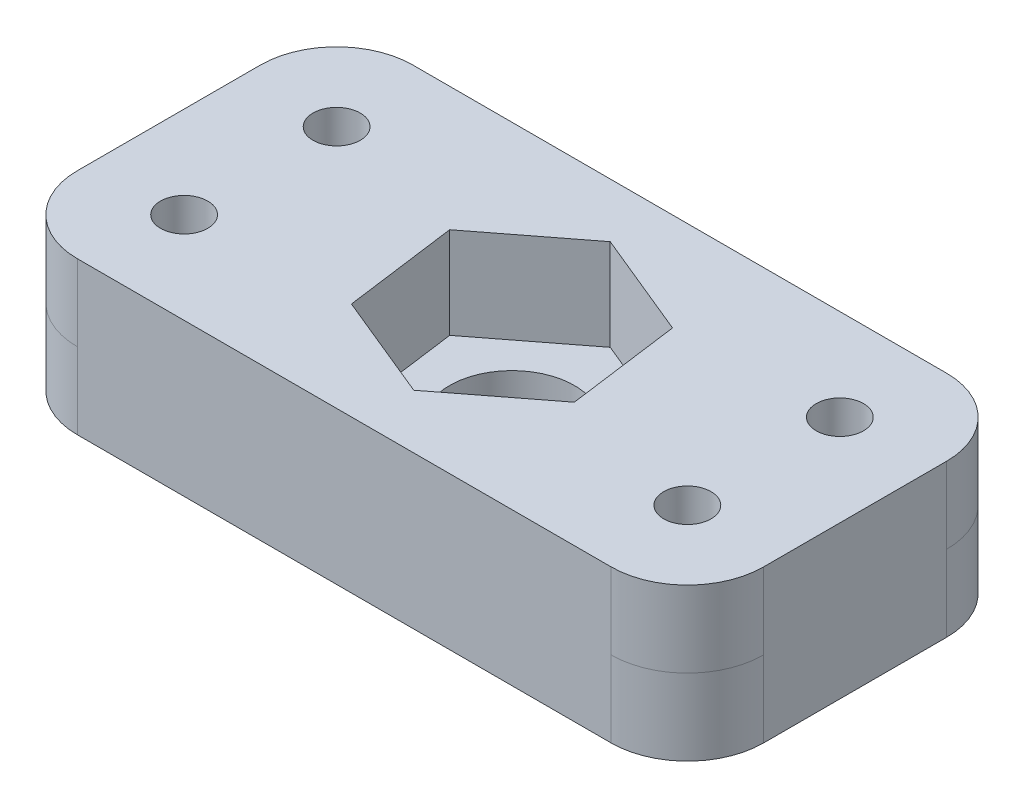
ISO-10303-21;
HEADER;
FILE_DESCRIPTION(('STEP AP214'),'2;1');
FILE_NAME('part.step','',(''),(''),'','','');
FILE_SCHEMA(('AUTOMOTIVE_DESIGN { 1 0 10303 214 1 1 1 1 }'));
ENDSEC;
DATA;
#1=APPLICATION_CONTEXT('core data for automotive mechanical design processes');
#2=APPLICATION_PROTOCOL_DEFINITION('international standard','automotive_design',2000,#1);
#3=PRODUCT_CONTEXT('',#1,'mechanical');
#4=PRODUCT('Part','Part','',(#3));
#5=PRODUCT_RELATED_PRODUCT_CATEGORY('part','',(#4));
#6=PRODUCT_DEFINITION_FORMATION('','',#4);
#7=PRODUCT_DEFINITION_CONTEXT('part definition',#1,'design');
#8=PRODUCT_DEFINITION('design','',#6,#7);
#9=PRODUCT_DEFINITION_SHAPE('','',#8);
#10=(LENGTH_UNIT() NAMED_UNIT(*) SI_UNIT(.MILLI.,.METRE.));
#11=(NAMED_UNIT(*) PLANE_ANGLE_UNIT() SI_UNIT($,.RADIAN.));
#12=(NAMED_UNIT(*) SI_UNIT($,.STERADIAN.) SOLID_ANGLE_UNIT());
#13=UNCERTAINTY_MEASURE_WITH_UNIT(LENGTH_MEASURE(1.E-05),#10,'distance_accuracy_value','');
#14=(GEOMETRIC_REPRESENTATION_CONTEXT(3) GLOBAL_UNCERTAINTY_ASSIGNED_CONTEXT((#13)) GLOBAL_UNIT_ASSIGNED_CONTEXT((#10,
#11,#12)) REPRESENTATION_CONTEXT('',''));
#15=CARTESIAN_POINT('',(0.,0.,0.));
#16=DIRECTION('',(0.,0.,1.));
#17=DIRECTION('',(1.,0.,0.));
#18=AXIS2_PLACEMENT_3D('',#15,#16,#17);
#19=CARTESIAN_POINT('',(0.,45.,0.));
#20=DIRECTION('',(0.,-1.,0.));
#21=DIRECTION('',(0.,0.,-1.));
#22=AXIS2_PLACEMENT_3D('',#19,#20,#21);
#23=CYLINDRICAL_SURFACE('',#22,4.1);
#24=CARTESIAN_POINT('',(0.,7.,0.));
#25=DIRECTION('',(0.,1.,0.));
#26=DIRECTION('',(0.,0.,1.));
#27=AXIS2_PLACEMENT_3D('',#24,#25,#26);
#28=CIRCLE('',#27,4.1);
#29=CARTESIAN_POINT('',(0.,7.,4.1));
#30=VERTEX_POINT('',#29);
#31=EDGE_CURVE('E348',#30,#30,#28,.T.);
#32=ORIENTED_EDGE('',*,*,#31,.F.);
#33=EDGE_LOOP('',(#32));
#34=FACE_BOUND('',#33,.T.);
#35=CARTESIAN_POINT('',(0.,11.,0.));
#36=DIRECTION('',(0.,1.,0.));
#37=DIRECTION('',(0.,0.,1.));
#38=AXIS2_PLACEMENT_3D('',#35,#36,#37);
#39=CIRCLE('',#38,4.1);
#40=CARTESIAN_POINT('',(0.,11.,4.1));
#41=VERTEX_POINT('',#40);
#42=EDGE_CURVE('E37',#41,#41,#39,.F.);
#43=ORIENTED_EDGE('',*,*,#42,.F.);
#44=EDGE_LOOP('',(#43));
#45=FACE_BOUND('',#44,.T.);
#46=ADVANCED_FACE('F33',(#34,#45),#23,.F.);
#47=CARTESIAN_POINT('',(-22.5,17.,-11.));
#48=DIRECTION('',(1.,0.,0.));
#49=DIRECTION('',(0.,0.,-1.));
#50=AXIS2_PLACEMENT_3D('',#47,#48,#49);
#51=PLANE('',#50);
#52=DIRECTION('',(0.,0.,-1.));
#53=VECTOR('',#52,1.);
#54=CARTESIAN_POINT('',(-22.5,7.,11.));
#55=LINE('',#54,#53);
#56=CARTESIAN_POINT('',(-22.5,7.,6.));
#57=VERTEX_POINT('',#56);
#58=CARTESIAN_POINT('',(-22.5,7.,-6.));
#59=VERTEX_POINT('',#58);
#60=EDGE_CURVE('E215',#57,#59,#55,.T.);
#61=ORIENTED_EDGE('',*,*,#60,.F.);
#62=DIRECTION('',(0.,1.,0.));
#63=VECTOR('',#62,1.);
#64=CARTESIAN_POINT('',(-22.5,17.,6.));
#65=LINE('',#64,#63);
#66=CARTESIAN_POINT('',(-22.5,12.,6.));
#67=VERTEX_POINT('',#66);
#68=EDGE_CURVE('E330',#57,#67,#65,.T.);
#69=ORIENTED_EDGE('',*,*,#68,.T.);
#70=DIRECTION('',(0.,-1.,0.));
#71=VECTOR('',#70,1.);
#72=CARTESIAN_POINT('',(-22.5,17.,6.));
#73=LINE('',#72,#71);
#74=CARTESIAN_POINT('',(-22.5,17.,6.));
#75=VERTEX_POINT('',#74);
#76=EDGE_CURVE('E435',#67,#75,#73,.F.);
#77=ORIENTED_EDGE('',*,*,#76,.T.);
#78=DIRECTION('',(0.,0.,1.));
#79=VECTOR('',#78,1.);
#80=CARTESIAN_POINT('',(-22.5,17.,-11.));
#81=LINE('',#80,#79);
#82=CARTESIAN_POINT('',(-22.5,17.,-6.));
#83=VERTEX_POINT('',#82);
#84=EDGE_CURVE('E227',#83,#75,#81,.T.);
#85=ORIENTED_EDGE('',*,*,#84,.F.);
#86=DIRECTION('',(0.,-1.,0.));
#87=VECTOR('',#86,1.);
#88=CARTESIAN_POINT('',(-22.5,17.,-6.));
#89=LINE('',#88,#87);
#90=CARTESIAN_POINT('',(-22.5,12.,-6.));
#91=VERTEX_POINT('',#90);
#92=EDGE_CURVE('E257',#83,#91,#89,.T.);
#93=ORIENTED_EDGE('',*,*,#92,.T.);
#94=DIRECTION('',(0.,1.,0.));
#95=VECTOR('',#94,1.);
#96=CARTESIAN_POINT('',(-22.5,17.,-6.));
#97=LINE('',#96,#95);
#98=EDGE_CURVE('E300',#91,#59,#97,.F.);
#99=ORIENTED_EDGE('',*,*,#98,.T.);
#100=EDGE_LOOP('',(#61,#69,#77,#85,#93,#99));
#101=FACE_BOUND('',#100,.T.);
#102=ADVANCED_FACE('F356',(#101),#51,.F.);
#103=CARTESIAN_POINT('',(22.5,17.,11.));
#104=DIRECTION('',(0.,0.,-1.));
#105=DIRECTION('',(-1.,0.,0.));
#106=AXIS2_PLACEMENT_3D('',#103,#104,#105);
#107=PLANE('',#106);
#108=DIRECTION('',(0.,-1.,0.));
#109=VECTOR('',#108,1.);
#110=CARTESIAN_POINT('',(-17.5,17.,11.));
#111=LINE('',#110,#109);
#112=CARTESIAN_POINT('',(-17.5,17.,11.));
#113=VERTEX_POINT('',#112);
#114=CARTESIAN_POINT('',(-17.5,12.,11.));
#115=VERTEX_POINT('',#114);
#116=EDGE_CURVE('E424',#113,#115,#111,.T.);
#117=ORIENTED_EDGE('',*,*,#116,.T.);
#118=DIRECTION('',(0.,1.,0.));
#119=VECTOR('',#118,1.);
#120=CARTESIAN_POINT('',(-17.5,17.,11.));
#121=LINE('',#120,#119);
#122=CARTESIAN_POINT('',(-17.5,7.,11.));
#123=VERTEX_POINT('',#122);
#124=EDGE_CURVE('E42',#115,#123,#121,.F.);
#125=ORIENTED_EDGE('',*,*,#124,.T.);
#126=DIRECTION('',(-1.,0.,0.));
#127=VECTOR('',#126,1.);
#128=CARTESIAN_POINT('',(22.5,7.,11.));
#129=LINE('',#128,#127);
#130=CARTESIAN_POINT('',(17.5,7.,11.));
#131=VERTEX_POINT('',#130);
#132=EDGE_CURVE('E224',#131,#123,#129,.T.);
#133=ORIENTED_EDGE('',*,*,#132,.F.);
#134=DIRECTION('',(0.,1.,0.));
#135=VECTOR('',#134,1.);
#136=CARTESIAN_POINT('',(17.5,17.,11.));
#137=LINE('',#136,#135);
#138=CARTESIAN_POINT('',(17.5,12.,11.));
#139=VERTEX_POINT('',#138);
#140=EDGE_CURVE('E319',#131,#139,#137,.T.);
#141=ORIENTED_EDGE('',*,*,#140,.T.);
#142=DIRECTION('',(0.,-1.,0.));
#143=VECTOR('',#142,1.);
#144=CARTESIAN_POINT('',(17.5,17.,11.));
#145=LINE('',#144,#143);
#146=CARTESIAN_POINT('',(17.5,17.,11.));
#147=VERTEX_POINT('',#146);
#148=EDGE_CURVE('E290',#139,#147,#145,.F.);
#149=ORIENTED_EDGE('',*,*,#148,.T.);
#150=DIRECTION('',(1.,0.,0.));
#151=VECTOR('',#150,1.);
#152=CARTESIAN_POINT('',(22.5,17.,11.));
#153=LINE('',#152,#151);
#154=EDGE_CURVE('E229',#113,#147,#153,.T.);
#155=ORIENTED_EDGE('',*,*,#154,.F.);
#156=EDGE_LOOP('',(#117,#125,#133,#141,#149,#155));
#157=FACE_BOUND('',#156,.T.);
#158=ADVANCED_FACE('F363',(#157),#107,.F.);
#159=CARTESIAN_POINT('',(22.5,17.,-11.));
#160=DIRECTION('',(-1.,0.,0.));
#161=DIRECTION('',(0.,0.,1.));
#162=AXIS2_PLACEMENT_3D('',#159,#160,#161);
#163=PLANE('',#162);
#164=DIRECTION('',(0.,-1.,0.));
#165=VECTOR('',#164,1.);
#166=CARTESIAN_POINT('',(22.5,17.,5.99999999999999));
#167=LINE('',#166,#165);
#168=CARTESIAN_POINT('',(22.5,17.,5.99999999999999));
#169=VERTEX_POINT('',#168);
#170=CARTESIAN_POINT('',(22.5,12.,5.99999999999999));
#171=VERTEX_POINT('',#170);
#172=EDGE_CURVE('E282',#169,#171,#167,.T.);
#173=ORIENTED_EDGE('',*,*,#172,.T.);
#174=DIRECTION('',(0.,1.,0.));
#175=VECTOR('',#174,1.);
#176=CARTESIAN_POINT('',(22.5,17.,5.99999999999999));
#177=LINE('',#176,#175);
#178=CARTESIAN_POINT('',(22.5,7.,6.));
#179=VERTEX_POINT('',#178);
#180=EDGE_CURVE('E322',#171,#179,#177,.F.);
#181=ORIENTED_EDGE('',*,*,#180,.T.);
#182=DIRECTION('',(0.,0.,1.));
#183=VECTOR('',#182,1.);
#184=CARTESIAN_POINT('',(22.5,7.,11.));
#185=LINE('',#184,#183);
#186=CARTESIAN_POINT('',(22.5,7.,-6.));
#187=VERTEX_POINT('',#186);
#188=EDGE_CURVE('E221',#187,#179,#185,.T.);
#189=ORIENTED_EDGE('',*,*,#188,.F.);
#190=DIRECTION('',(0.,1.,0.));
#191=VECTOR('',#190,1.);
#192=CARTESIAN_POINT('',(22.5,17.,-6.));
#193=LINE('',#192,#191);
#194=CARTESIAN_POINT('',(22.5,12.,-6.));
#195=VERTEX_POINT('',#194);
#196=EDGE_CURVE('E309',#187,#195,#193,.T.);
#197=ORIENTED_EDGE('',*,*,#196,.T.);
#198=DIRECTION('',(0.,-1.,0.));
#199=VECTOR('',#198,1.);
#200=CARTESIAN_POINT('',(22.5,17.,-6.));
#201=LINE('',#200,#199);
#202=CARTESIAN_POINT('',(22.5,17.,-6.));
#203=VERTEX_POINT('',#202);
#204=EDGE_CURVE('E246',#195,#203,#201,.F.);
#205=ORIENTED_EDGE('',*,*,#204,.T.);
#206=DIRECTION('',(0.,0.,-1.));
#207=VECTOR('',#206,1.);
#208=CARTESIAN_POINT('',(22.5,17.,-11.));
#209=LINE('',#208,#207);
#210=EDGE_CURVE('E232',#169,#203,#209,.T.);
#211=ORIENTED_EDGE('',*,*,#210,.F.);
#212=EDGE_LOOP('',(#173,#181,#189,#197,#205,#211));
#213=FACE_BOUND('',#212,.T.);
#214=ADVANCED_FACE('F378',(#213),#163,.F.);
#215=CARTESIAN_POINT('',(22.5,17.,-11.));
#216=DIRECTION('',(0.,0.,1.));
#217=DIRECTION('',(1.,0.,0.));
#218=AXIS2_PLACEMENT_3D('',#215,#216,#217);
#219=PLANE('',#218);
#220=DIRECTION('',(0.,-1.,0.));
#221=VECTOR('',#220,1.);
#222=CARTESIAN_POINT('',(17.5,17.,-11.));
#223=LINE('',#222,#221);
#224=CARTESIAN_POINT('',(17.5,17.,-11.));
#225=VERTEX_POINT('',#224);
#226=CARTESIAN_POINT('',(17.5,12.,-11.));
#227=VERTEX_POINT('',#226);
#228=EDGE_CURVE('E237',#225,#227,#223,.T.);
#229=ORIENTED_EDGE('',*,*,#228,.T.);
#230=DIRECTION('',(0.,1.,0.));
#231=VECTOR('',#230,1.);
#232=CARTESIAN_POINT('',(17.5,17.,-11.));
#233=LINE('',#232,#231);
#234=CARTESIAN_POINT('',(17.5,7.,-11.));
#235=VERTEX_POINT('',#234);
#236=EDGE_CURVE('E311',#227,#235,#233,.F.);
#237=ORIENTED_EDGE('',*,*,#236,.T.);
#238=DIRECTION('',(1.,0.,0.));
#239=VECTOR('',#238,1.);
#240=CARTESIAN_POINT('',(22.5,7.,-11.));
#241=LINE('',#240,#239);
#242=CARTESIAN_POINT('',(-17.5,7.,-11.));
#243=VERTEX_POINT('',#242);
#244=EDGE_CURVE('E217',#243,#235,#241,.T.);
#245=ORIENTED_EDGE('',*,*,#244,.F.);
#246=DIRECTION('',(0.,1.,0.));
#247=VECTOR('',#246,1.);
#248=CARTESIAN_POINT('',(-17.5,17.,-11.));
#249=LINE('',#248,#247);
#250=CARTESIAN_POINT('',(-17.5,12.,-11.));
#251=VERTEX_POINT('',#250);
#252=EDGE_CURVE('E266',#243,#251,#249,.T.);
#253=ORIENTED_EDGE('',*,*,#252,.T.);
#254=DIRECTION('',(0.,-1.,0.));
#255=VECTOR('',#254,1.);
#256=CARTESIAN_POINT('',(-17.5,17.,-11.));
#257=LINE('',#256,#255);
#258=CARTESIAN_POINT('',(-17.5,17.,-11.));
#259=VERTEX_POINT('',#258);
#260=EDGE_CURVE('E256',#251,#259,#257,.F.);
#261=ORIENTED_EDGE('',*,*,#260,.T.);
#262=DIRECTION('',(-1.,0.,0.));
#263=VECTOR('',#262,1.);
#264=CARTESIAN_POINT('',(22.5,17.,-11.));
#265=LINE('',#264,#263);
#266=EDGE_CURVE('E234',#225,#259,#265,.T.);
#267=ORIENTED_EDGE('',*,*,#266,.F.);
#268=EDGE_LOOP('',(#229,#237,#245,#253,#261,#267));
#269=FACE_BOUND('',#268,.T.);
#270=ADVANCED_FACE('F374',(#269),#219,.F.);
#271=CARTESIAN_POINT('',(0.,17.,0.));
#272=DIRECTION('',(0.,-1.,0.));
#273=DIRECTION('',(0.,0.,-1.));
#274=AXIS2_PLACEMENT_3D('',#271,#272,#273);
#275=PLANE('',#274);
#276=DIRECTION('',(-0.132947559546224,0.,-0.991123073291457));
#277=VECTOR('',#276,1.);
#278=CARTESIAN_POINT('',(6.94122248679323,17.,2.85530448852121));
#279=LINE('',#278,#277);
#280=CARTESIAN_POINT('',(6.94122248679323,17.,2.85530448852121));
#281=VERTEX_POINT('',#280);
#282=CARTESIAN_POINT('',(5.94337746599572,17.,-4.58362276262212));
#283=VERTEX_POINT('',#282);
#284=EDGE_CURVE('E196',#281,#283,#279,.T.);
#285=ORIENTED_EDGE('',*,*,#284,.F.);
#286=DIRECTION('',(0.791863979974196,0.,-0.610697500583903));
#287=VECTOR('',#286,1.);
#288=CARTESIAN_POINT('',(0.997845020797509,17.,7.43892725114334));
#289=LINE('',#288,#287);
#290=CARTESIAN_POINT('',(0.997845020797509,17.,7.43892725114334));
#291=VERTEX_POINT('',#290);
#292=EDGE_CURVE('E50',#291,#281,#289,.T.);
#293=ORIENTED_EDGE('',*,*,#292,.F.);
#294=DIRECTION('',(0.92481153952042,0.,0.380425572707555));
#295=VECTOR('',#294,1.);
#296=CARTESIAN_POINT('',(-5.94337746599572,17.,4.58362276262212));
#297=LINE('',#296,#295);
#298=CARTESIAN_POINT('',(-5.94337746599572,17.,4.58362276262212));
#299=VERTEX_POINT('',#298);
#300=EDGE_CURVE('E182',#299,#291,#297,.T.);
#301=ORIENTED_EDGE('',*,*,#300,.F.);
#302=DIRECTION('',(0.132947559546224,0.,0.991123073291457));
#303=VECTOR('',#302,1.);
#304=CARTESIAN_POINT('',(-6.94122248679323,17.,-2.85530448852122));
#305=LINE('',#304,#303);
#306=CARTESIAN_POINT('',(-6.94122248679323,17.,-2.85530448852122));
#307=VERTEX_POINT('',#306);
#308=EDGE_CURVE('E185',#307,#299,#305,.T.);
#309=ORIENTED_EDGE('',*,*,#308,.F.);
#310=DIRECTION('',(-0.791863979974196,0.,0.610697500583903));
#311=VECTOR('',#310,1.);
#312=CARTESIAN_POINT('',(-0.997845020797508,17.,-7.43892725114334));
#313=LINE('',#312,#311);
#314=CARTESIAN_POINT('',(-0.997845020797508,17.,-7.43892725114334));
#315=VERTEX_POINT('',#314);
#316=EDGE_CURVE('E201',#315,#307,#313,.T.);
#317=ORIENTED_EDGE('',*,*,#316,.F.);
#318=DIRECTION('',(-0.92481153952042,0.,-0.380425572707555));
#319=VECTOR('',#318,1.);
#320=CARTESIAN_POINT('',(5.94337746599572,17.,-4.58362276262212));
#321=LINE('',#320,#319);
#322=EDGE_CURVE('E198',#283,#315,#321,.T.);
#323=ORIENTED_EDGE('',*,*,#322,.F.);
#324=EDGE_LOOP('',(#285,#293,#301,#309,#317,#323));
#325=FACE_BOUND('',#324,.T.);
#326=CARTESIAN_POINT('',(16.5,17.,-5.));
#327=DIRECTION('',(0.,-1.,0.));
#328=DIRECTION('',(0.,0.,-1.));
#329=AXIS2_PLACEMENT_3D('',#326,#327,#328);
#330=CIRCLE('',#329,1.55);
#331=CARTESIAN_POINT('',(16.5,17.,-6.55000000000001));
#332=VERTEX_POINT('',#331);
#333=EDGE_CURVE('E226',#332,#332,#330,.T.);
#334=ORIENTED_EDGE('',*,*,#333,.T.);
#335=EDGE_LOOP('',(#334));
#336=FACE_BOUND('',#335,.T.);
#337=CARTESIAN_POINT('',(16.5,17.,5.));
#338=DIRECTION('',(0.,-1.,0.));
#339=DIRECTION('',(0.,0.,-1.));
#340=AXIS2_PLACEMENT_3D('',#337,#338,#339);
#341=CIRCLE('',#340,1.55);
#342=CARTESIAN_POINT('',(16.5,17.,3.44999999999999));
#343=VERTEX_POINT('',#342);
#344=EDGE_CURVE('E272',#343,#343,#341,.T.);
#345=ORIENTED_EDGE('',*,*,#344,.T.);
#346=EDGE_LOOP('',(#345));
#347=FACE_BOUND('',#346,.T.);
#348=CARTESIAN_POINT('',(-16.5,17.,-5.));
#349=DIRECTION('',(0.,-1.,0.));
#350=DIRECTION('',(0.,0.,-1.));
#351=AXIS2_PLACEMENT_3D('',#348,#349,#350);
#352=CIRCLE('',#351,1.55);
#353=CARTESIAN_POINT('',(-16.5,17.,-6.55));
#354=VERTEX_POINT('',#353);
#355=EDGE_CURVE('E269',#354,#354,#352,.T.);
#356=ORIENTED_EDGE('',*,*,#355,.T.);
#357=EDGE_LOOP('',(#356));
#358=FACE_BOUND('',#357,.T.);
#359=CARTESIAN_POINT('',(-16.5,17.,5.));
#360=DIRECTION('',(0.,-1.,0.));
#361=DIRECTION('',(0.,0.,-1.));
#362=AXIS2_PLACEMENT_3D('',#359,#360,#361);
#363=CIRCLE('',#362,1.55);
#364=CARTESIAN_POINT('',(-16.5,17.,3.45));
#365=VERTEX_POINT('',#364);
#366=EDGE_CURVE('E230',#365,#365,#363,.T.);
#367=ORIENTED_EDGE('',*,*,#366,.T.);
#368=EDGE_LOOP('',(#367));
#369=FACE_BOUND('',#368,.T.);
#370=ORIENTED_EDGE('',*,*,#266,.T.);
#371=CARTESIAN_POINT('',(-17.5,17.,-6.));
#372=DIRECTION('',(0.,-1.,0.));
#373=DIRECTION('',(0.,0.,-1.));
#374=AXIS2_PLACEMENT_3D('',#371,#372,#373);
#375=CIRCLE('',#374,5.);
#376=EDGE_CURVE('E264',#259,#83,#375,.F.);
#377=ORIENTED_EDGE('',*,*,#376,.T.);
#378=ORIENTED_EDGE('',*,*,#84,.T.);
#379=CARTESIAN_POINT('',(-17.5,17.,6.));
#380=DIRECTION('',(0.,-1.,0.));
#381=DIRECTION('',(0.,0.,-1.));
#382=AXIS2_PLACEMENT_3D('',#379,#380,#381);
#383=CIRCLE('',#382,5.);
#384=EDGE_CURVE('E262',#75,#113,#383,.F.);
#385=ORIENTED_EDGE('',*,*,#384,.T.);
#386=ORIENTED_EDGE('',*,*,#154,.T.);
#387=CARTESIAN_POINT('',(17.5,17.,5.99999999999999));
#388=DIRECTION('',(0.,-1.,0.));
#389=DIRECTION('',(0.,0.,-1.));
#390=AXIS2_PLACEMENT_3D('',#387,#388,#389);
#391=CIRCLE('',#390,5.);
#392=EDGE_CURVE('E423',#147,#169,#391,.F.);
#393=ORIENTED_EDGE('',*,*,#392,.T.);
#394=ORIENTED_EDGE('',*,*,#210,.T.);
#395=CARTESIAN_POINT('',(17.5,17.,-6.));
#396=DIRECTION('',(0.,-1.,0.));
#397=DIRECTION('',(0.,0.,-1.));
#398=AXIS2_PLACEMENT_3D('',#395,#396,#397);
#399=CIRCLE('',#398,5.);
#400=EDGE_CURVE('E240',#203,#225,#399,.F.);
#401=ORIENTED_EDGE('',*,*,#400,.T.);
#402=EDGE_LOOP('',(#370,#377,#378,#385,#386,#393,#394,#401));
#403=FACE_BOUND('',#402,.T.);
#404=ADVANCED_FACE('F370',(#325,#336,#347,#358,#369,#403),#275,.F.);
#405=CARTESIAN_POINT('',(17.5,17.,-6.));
#406=DIRECTION('',(0.,-1.,0.));
#407=DIRECTION('',(0.,0.,-1.));
#408=AXIS2_PLACEMENT_3D('',#405,#406,#407);
#409=CYLINDRICAL_SURFACE('',#408,5.);
#410=ORIENTED_EDGE('',*,*,#400,.F.);
#411=ORIENTED_EDGE('',*,*,#204,.F.);
#412=CARTESIAN_POINT('',(17.5,12.,-6.));
#413=DIRECTION('',(0.,-1.,0.));
#414=DIRECTION('',(0.,0.,-1.));
#415=AXIS2_PLACEMENT_3D('',#412,#413,#414);
#416=CIRCLE('',#415,5.);
#417=EDGE_CURVE('E243',#227,#195,#416,.T.);
#418=ORIENTED_EDGE('',*,*,#417,.F.);
#419=ORIENTED_EDGE('',*,*,#228,.F.);
#420=EDGE_LOOP('',(#410,#411,#418,#419));
#421=FACE_BOUND('',#420,.T.);
#422=ADVANCED_FACE('F373',(#421),#409,.T.);
#423=CARTESIAN_POINT('',(17.5,17.,5.99999999999999));
#424=DIRECTION('',(0.,-1.,0.));
#425=DIRECTION('',(0.,0.,-1.));
#426=AXIS2_PLACEMENT_3D('',#423,#424,#425);
#427=CYLINDRICAL_SURFACE('',#426,5.);
#428=ORIENTED_EDGE('',*,*,#392,.F.);
#429=ORIENTED_EDGE('',*,*,#148,.F.);
#430=CARTESIAN_POINT('',(17.5,12.,5.99999999999999));
#431=DIRECTION('',(0.,-1.,0.));
#432=DIRECTION('',(0.,0.,-1.));
#433=AXIS2_PLACEMENT_3D('',#430,#431,#432);
#434=CIRCLE('',#433,5.);
#435=EDGE_CURVE('E286',#171,#139,#434,.T.);
#436=ORIENTED_EDGE('',*,*,#435,.F.);
#437=ORIENTED_EDGE('',*,*,#172,.F.);
#438=EDGE_LOOP('',(#428,#429,#436,#437));
#439=FACE_BOUND('',#438,.T.);
#440=ADVANCED_FACE('F386',(#439),#427,.T.);
#441=CARTESIAN_POINT('',(-17.5,17.,6.));
#442=DIRECTION('',(0.,-1.,0.));
#443=DIRECTION('',(0.,0.,-1.));
#444=AXIS2_PLACEMENT_3D('',#441,#442,#443);
#445=CYLINDRICAL_SURFACE('',#444,5.);
#446=ORIENTED_EDGE('',*,*,#384,.F.);
#447=ORIENTED_EDGE('',*,*,#76,.F.);
#448=CARTESIAN_POINT('',(-17.5,12.,6.));
#449=DIRECTION('',(0.,-1.,0.));
#450=DIRECTION('',(0.,0.,-1.));
#451=AXIS2_PLACEMENT_3D('',#448,#449,#450);
#452=CIRCLE('',#451,5.);
#453=EDGE_CURVE('E432',#115,#67,#452,.T.);
#454=ORIENTED_EDGE('',*,*,#453,.F.);
#455=ORIENTED_EDGE('',*,*,#116,.F.);
#456=EDGE_LOOP('',(#446,#447,#454,#455));
#457=FACE_BOUND('',#456,.T.);
#458=ADVANCED_FACE('F390',(#457),#445,.T.);
#459=CARTESIAN_POINT('',(-17.5,17.,-6.));
#460=DIRECTION('',(0.,-1.,0.));
#461=DIRECTION('',(0.,0.,-1.));
#462=AXIS2_PLACEMENT_3D('',#459,#460,#461);
#463=CYLINDRICAL_SURFACE('',#462,5.);
#464=ORIENTED_EDGE('',*,*,#376,.F.);
#465=ORIENTED_EDGE('',*,*,#260,.F.);
#466=CARTESIAN_POINT('',(-17.5,12.,-6.));
#467=DIRECTION('',(0.,-1.,0.));
#468=DIRECTION('',(0.,0.,-1.));
#469=AXIS2_PLACEMENT_3D('',#466,#467,#468);
#470=CIRCLE('',#469,5.);
#471=EDGE_CURVE('E253',#91,#251,#470,.T.);
#472=ORIENTED_EDGE('',*,*,#471,.F.);
#473=ORIENTED_EDGE('',*,*,#92,.F.);
#474=EDGE_LOOP('',(#464,#465,#472,#473));
#475=FACE_BOUND('',#474,.T.);
#476=ADVANCED_FACE('F394',(#475),#463,.T.);
#477=CARTESIAN_POINT('',(-16.5,57.,5.));
#478=DIRECTION('',(0.,-1.,0.));
#479=DIRECTION('',(0.,0.,-1.));
#480=AXIS2_PLACEMENT_3D('',#477,#478,#479);
#481=CYLINDRICAL_SURFACE('',#480,1.55);
#482=ORIENTED_EDGE('',*,*,#366,.F.);
#483=EDGE_LOOP('',(#482));
#484=FACE_BOUND('',#483,.T.);
#485=CARTESIAN_POINT('',(-16.5,7.,5.));
#486=DIRECTION('',(0.,1.,0.));
#487=DIRECTION('',(0.,0.,1.));
#488=AXIS2_PLACEMENT_3D('',#485,#486,#487);
#489=CIRCLE('',#488,1.55);
#490=CARTESIAN_POINT('',(-16.5,7.,6.54999999999999));
#491=VERTEX_POINT('',#490);
#492=EDGE_CURVE('E218',#491,#491,#489,.T.);
#493=ORIENTED_EDGE('',*,*,#492,.F.);
#494=EDGE_LOOP('',(#493));
#495=FACE_BOUND('',#494,.T.);
#496=ADVANCED_FACE('F368',(#484,#495),#481,.F.);
#497=CARTESIAN_POINT('',(-16.5,57.,-5.));
#498=DIRECTION('',(0.,-1.,0.));
#499=DIRECTION('',(0.,0.,-1.));
#500=AXIS2_PLACEMENT_3D('',#497,#498,#499);
#501=CYLINDRICAL_SURFACE('',#500,1.55);
#502=ORIENTED_EDGE('',*,*,#355,.F.);
#503=EDGE_LOOP('',(#502));
#504=FACE_BOUND('',#503,.T.);
#505=CARTESIAN_POINT('',(-16.5,7.,-5.));
#506=DIRECTION('',(0.,1.,0.));
#507=DIRECTION('',(0.,0.,1.));
#508=AXIS2_PLACEMENT_3D('',#505,#506,#507);
#509=CIRCLE('',#508,1.55);
#510=CARTESIAN_POINT('',(-16.5,7.,-3.45));
#511=VERTEX_POINT('',#510);
#512=EDGE_CURVE('E340',#511,#511,#509,.T.);
#513=ORIENTED_EDGE('',*,*,#512,.F.);
#514=EDGE_LOOP('',(#513));
#515=FACE_BOUND('',#514,.T.);
#516=ADVANCED_FACE('F474',(#504,#515),#501,.F.);
#517=CARTESIAN_POINT('',(16.5,57.,5.));
#518=DIRECTION('',(0.,-1.,0.));
#519=DIRECTION('',(0.,0.,-1.));
#520=AXIS2_PLACEMENT_3D('',#517,#518,#519);
#521=CYLINDRICAL_SURFACE('',#520,1.55);
#522=ORIENTED_EDGE('',*,*,#344,.F.);
#523=EDGE_LOOP('',(#522));
#524=FACE_BOUND('',#523,.T.);
#525=CARTESIAN_POINT('',(16.5,7.,5.));
#526=DIRECTION('',(0.,1.,0.));
#527=DIRECTION('',(0.,0.,1.));
#528=AXIS2_PLACEMENT_3D('',#525,#526,#527);
#529=CIRCLE('',#528,1.55);
#530=CARTESIAN_POINT('',(16.5,7.,6.55));
#531=VERTEX_POINT('',#530);
#532=EDGE_CURVE('E343',#531,#531,#529,.T.);
#533=ORIENTED_EDGE('',*,*,#532,.F.);
#534=EDGE_LOOP('',(#533));
#535=FACE_BOUND('',#534,.T.);
#536=ADVANCED_FACE('F466',(#524,#535),#521,.F.);
#537=CARTESIAN_POINT('',(16.5,57.,-5.));
#538=DIRECTION('',(0.,-1.,0.));
#539=DIRECTION('',(0.,0.,-1.));
#540=AXIS2_PLACEMENT_3D('',#537,#538,#539);
#541=CYLINDRICAL_SURFACE('',#540,1.55);
#542=ORIENTED_EDGE('',*,*,#333,.F.);
#543=EDGE_LOOP('',(#542));
#544=FACE_BOUND('',#543,.T.);
#545=CARTESIAN_POINT('',(16.5,7.,-5.));
#546=DIRECTION('',(0.,1.,0.));
#547=DIRECTION('',(0.,0.,1.));
#548=AXIS2_PLACEMENT_3D('',#545,#546,#547);
#549=CIRCLE('',#548,1.55);
#550=CARTESIAN_POINT('',(16.5,7.,-3.45));
#551=VERTEX_POINT('',#550);
#552=EDGE_CURVE('E346',#551,#551,#549,.T.);
#553=ORIENTED_EDGE('',*,*,#552,.F.);
#554=EDGE_LOOP('',(#553));
#555=FACE_BOUND('',#554,.T.);
#556=ADVANCED_FACE('F461',(#544,#555),#541,.F.);
#557=CARTESIAN_POINT('',(0.,7.,0.));
#558=DIRECTION('',(0.,1.,0.));
#559=DIRECTION('',(0.,0.,1.));
#560=AXIS2_PLACEMENT_3D('',#557,#558,#559);
#561=PLANE('',#560);
#562=ORIENTED_EDGE('',*,*,#31,.T.);
#563=EDGE_LOOP('',(#562));
#564=FACE_BOUND('',#563,.T.);
#565=ORIENTED_EDGE('',*,*,#552,.T.);
#566=EDGE_LOOP('',(#565));
#567=FACE_BOUND('',#566,.T.);
#568=ORIENTED_EDGE('',*,*,#532,.T.);
#569=EDGE_LOOP('',(#568));
#570=FACE_BOUND('',#569,.T.);
#571=ORIENTED_EDGE('',*,*,#512,.T.);
#572=EDGE_LOOP('',(#571));
#573=FACE_BOUND('',#572,.T.);
#574=ORIENTED_EDGE('',*,*,#492,.T.);
#575=EDGE_LOOP('',(#574));
#576=FACE_BOUND('',#575,.T.);
#577=ORIENTED_EDGE('',*,*,#132,.T.);
#578=CARTESIAN_POINT('',(-17.5,7.,6.));
#579=DIRECTION('',(0.,1.,0.));
#580=DIRECTION('',(0.,0.,1.));
#581=AXIS2_PLACEMENT_3D('',#578,#579,#580);
#582=CIRCLE('',#581,5.);
#583=EDGE_CURVE('E11',#123,#57,#582,.F.);
#584=ORIENTED_EDGE('',*,*,#583,.T.);
#585=ORIENTED_EDGE('',*,*,#60,.T.);
#586=CARTESIAN_POINT('',(-17.5,7.,-6.));
#587=DIRECTION('',(0.,1.,0.));
#588=DIRECTION('',(0.,0.,1.));
#589=AXIS2_PLACEMENT_3D('',#586,#587,#588);
#590=CIRCLE('',#589,5.);
#591=EDGE_CURVE('E305',#59,#243,#590,.F.);
#592=ORIENTED_EDGE('',*,*,#591,.T.);
#593=ORIENTED_EDGE('',*,*,#244,.T.);
#594=CARTESIAN_POINT('',(17.5,7.,-6.));
#595=DIRECTION('',(0.,1.,0.));
#596=DIRECTION('',(0.,0.,1.));
#597=AXIS2_PLACEMENT_3D('',#594,#595,#596);
#598=CIRCLE('',#597,5.);
#599=EDGE_CURVE('E315',#235,#187,#598,.F.);
#600=ORIENTED_EDGE('',*,*,#599,.T.);
#601=ORIENTED_EDGE('',*,*,#188,.T.);
#602=CARTESIAN_POINT('',(17.5,7.,6.));
#603=DIRECTION('',(0.,1.,0.));
#604=DIRECTION('',(0.,0.,1.));
#605=AXIS2_PLACEMENT_3D('',#602,#603,#604);
#606=CIRCLE('',#605,5.);
#607=EDGE_CURVE('E326',#179,#131,#606,.F.);
#608=ORIENTED_EDGE('',*,*,#607,.T.);
#609=EDGE_LOOP('',(#577,#584,#585,#592,#593,#600,#601,#608));
#610=FACE_BOUND('',#609,.T.);
#611=ADVANCED_FACE('F403',(#564,#567,#570,#573,#576,#610),#561,.F.);
#612=CARTESIAN_POINT('',(-17.5,17.,-6.));
#613=DIRECTION('',(0.,1.,0.));
#614=DIRECTION('',(0.,0.,1.));
#615=AXIS2_PLACEMENT_3D('',#612,#613,#614);
#616=CYLINDRICAL_SURFACE('',#615,5.);
#617=ORIENTED_EDGE('',*,*,#591,.F.);
#618=ORIENTED_EDGE('',*,*,#98,.F.);
#619=ORIENTED_EDGE('',*,*,#471,.T.);
#620=ORIENTED_EDGE('',*,*,#252,.F.);
#621=EDGE_LOOP('',(#617,#618,#619,#620));
#622=FACE_BOUND('',#621,.T.);
#623=ADVANCED_FACE('F399',(#622),#616,.T.);
#624=CARTESIAN_POINT('',(17.5,17.,-6.));
#625=DIRECTION('',(0.,1.,0.));
#626=DIRECTION('',(0.,0.,1.));
#627=AXIS2_PLACEMENT_3D('',#624,#625,#626);
#628=CYLINDRICAL_SURFACE('',#627,5.);
#629=ORIENTED_EDGE('',*,*,#599,.F.);
#630=ORIENTED_EDGE('',*,*,#236,.F.);
#631=ORIENTED_EDGE('',*,*,#417,.T.);
#632=ORIENTED_EDGE('',*,*,#196,.F.);
#633=EDGE_LOOP('',(#629,#630,#631,#632));
#634=FACE_BOUND('',#633,.T.);
#635=ADVANCED_FACE('F402',(#634),#628,.T.);
#636=CARTESIAN_POINT('',(17.5,17.,6.));
#637=DIRECTION('',(0.,1.,0.));
#638=DIRECTION('',(0.,0.,1.));
#639=AXIS2_PLACEMENT_3D('',#636,#637,#638);
#640=CYLINDRICAL_SURFACE('',#639,5.);
#641=ORIENTED_EDGE('',*,*,#607,.F.);
#642=ORIENTED_EDGE('',*,*,#180,.F.);
#643=ORIENTED_EDGE('',*,*,#435,.T.);
#644=ORIENTED_EDGE('',*,*,#140,.F.);
#645=EDGE_LOOP('',(#641,#642,#643,#644));
#646=FACE_BOUND('',#645,.T.);
#647=ADVANCED_FACE('F406',(#646),#640,.T.);
#648=CARTESIAN_POINT('',(-17.5,17.,6.));
#649=DIRECTION('',(0.,1.,0.));
#650=DIRECTION('',(0.,0.,1.));
#651=AXIS2_PLACEMENT_3D('',#648,#649,#650);
#652=CYLINDRICAL_SURFACE('',#651,5.);
#653=ORIENTED_EDGE('',*,*,#583,.F.);
#654=ORIENTED_EDGE('',*,*,#124,.F.);
#655=ORIENTED_EDGE('',*,*,#453,.T.);
#656=ORIENTED_EDGE('',*,*,#68,.F.);
#657=EDGE_LOOP('',(#653,#654,#655,#656));
#658=FACE_BOUND('',#657,.T.);
#659=ADVANCED_FACE('F35',(#658),#652,.T.);
#660=CARTESIAN_POINT('',(0.,11.,0.));
#661=DIRECTION('',(0.,1.,0.));
#662=DIRECTION('',(0.,0.,1.));
#663=AXIS2_PLACEMENT_3D('',#660,#661,#662);
#664=PLANE('',#663);
#665=DIRECTION('',(0.791863979974196,0.,-0.610697500583903));
#666=VECTOR('',#665,1.);
#667=CARTESIAN_POINT('',(0.997845020797509,11.,7.43892725114334));
#668=LINE('',#667,#666);
#669=CARTESIAN_POINT('',(0.997845020797509,11.,7.43892725114334));
#670=VERTEX_POINT('',#669);
#671=CARTESIAN_POINT('',(6.94122248679323,11.,2.85530448852121));
#672=VERTEX_POINT('',#671);
#673=EDGE_CURVE('E162',#670,#672,#668,.T.);
#674=ORIENTED_EDGE('',*,*,#673,.T.);
#675=DIRECTION('',(-0.132947559546224,0.,-0.991123073291457));
#676=VECTOR('',#675,1.);
#677=CARTESIAN_POINT('',(6.94122248679323,11.,2.85530448852121));
#678=LINE('',#677,#676);
#679=CARTESIAN_POINT('',(5.94337746599572,11.,-4.58362276262212));
#680=VERTEX_POINT('',#679);
#681=EDGE_CURVE('E171',#672,#680,#678,.T.);
#682=ORIENTED_EDGE('',*,*,#681,.T.);
#683=DIRECTION('',(-0.92481153952042,0.,-0.380425572707555));
#684=VECTOR('',#683,1.);
#685=CARTESIAN_POINT('',(5.94337746599572,11.,-4.58362276262212));
#686=LINE('',#685,#684);
#687=CARTESIAN_POINT('',(-0.997845020797508,11.,-7.43892725114334));
#688=VERTEX_POINT('',#687);
#689=EDGE_CURVE('E176',#680,#688,#686,.T.);
#690=ORIENTED_EDGE('',*,*,#689,.T.);
#691=DIRECTION('',(-0.791863979974196,0.,0.610697500583903));
#692=VECTOR('',#691,1.);
#693=CARTESIAN_POINT('',(-0.997845020797508,11.,-7.43892725114334));
#694=LINE('',#693,#692);
#695=CARTESIAN_POINT('',(-6.94122248679323,11.,-2.85530448852122));
#696=VERTEX_POINT('',#695);
#697=EDGE_CURVE('E189',#688,#696,#694,.T.);
#698=ORIENTED_EDGE('',*,*,#697,.T.);
#699=DIRECTION('',(0.132947559546224,0.,0.991123073291457));
#700=VECTOR('',#699,1.);
#701=CARTESIAN_POINT('',(-6.94122248679323,11.,-2.85530448852122));
#702=LINE('',#701,#700);
#703=CARTESIAN_POINT('',(-5.94337746599572,11.,4.58362276262212));
#704=VERTEX_POINT('',#703);
#705=EDGE_CURVE('E192',#696,#704,#702,.T.);
#706=ORIENTED_EDGE('',*,*,#705,.T.);
#707=DIRECTION('',(0.92481153952042,0.,0.380425572707555));
#708=VECTOR('',#707,1.);
#709=CARTESIAN_POINT('',(-5.94337746599572,11.,4.58362276262212));
#710=LINE('',#709,#708);
#711=EDGE_CURVE('E168',#704,#670,#710,.T.);
#712=ORIENTED_EDGE('',*,*,#711,.T.);
#713=EDGE_LOOP('',(#674,#682,#690,#698,#706,#712));
#714=FACE_BOUND('',#713,.T.);
#715=ORIENTED_EDGE('',*,*,#42,.T.);
#716=EDGE_LOOP('',(#715));
#717=FACE_BOUND('',#716,.T.);
#718=ADVANCED_FACE('F178',(#714,#717),#664,.T.);
#719=CARTESIAN_POINT('',(0.997845020797509,11.,7.43892725114334));
#720=DIRECTION('',(0.610697500583903,0.,0.791863979974196));
#721=DIRECTION('',(0.791863979974196,0.,-0.610697500583903));
#722=AXIS2_PLACEMENT_3D('',#719,#720,#721);
#723=PLANE('',#722);
#724=ORIENTED_EDGE('',*,*,#292,.T.);
#725=DIRECTION('',(0.,1.,0.));
#726=VECTOR('',#725,1.);
#727=CARTESIAN_POINT('',(6.94122248679323,11.,2.85530448852121));
#728=LINE('',#727,#726);
#729=EDGE_CURVE('E158',#672,#281,#728,.T.);
#730=ORIENTED_EDGE('',*,*,#729,.F.);
#731=ORIENTED_EDGE('',*,*,#673,.F.);
#732=DIRECTION('',(0.,1.,0.));
#733=VECTOR('',#732,1.);
#734=CARTESIAN_POINT('',(0.997845020797509,11.,7.43892725114334));
#735=LINE('',#734,#733);
#736=EDGE_CURVE('E206',#670,#291,#735,.T.);
#737=ORIENTED_EDGE('',*,*,#736,.T.);
#738=EDGE_LOOP('',(#724,#730,#731,#737));
#739=FACE_BOUND('',#738,.T.);
#740=ADVANCED_FACE('F160',(#739),#723,.F.);
#741=CARTESIAN_POINT('',(-5.94337746599572,11.,4.58362276262212));
#742=DIRECTION('',(-0.380425572707555,0.,0.92481153952042));
#743=DIRECTION('',(0.92481153952042,0.,0.380425572707555));
#744=AXIS2_PLACEMENT_3D('',#741,#742,#743);
#745=PLANE('',#744);
#746=ORIENTED_EDGE('',*,*,#300,.T.);
#747=ORIENTED_EDGE('',*,*,#736,.F.);
#748=ORIENTED_EDGE('',*,*,#711,.F.);
#749=DIRECTION('',(0.,1.,0.));
#750=VECTOR('',#749,1.);
#751=CARTESIAN_POINT('',(-5.94337746599572,11.,4.58362276262212));
#752=LINE('',#751,#750);
#753=EDGE_CURVE('E208',#704,#299,#752,.T.);
#754=ORIENTED_EDGE('',*,*,#753,.T.);
#755=EDGE_LOOP('',(#746,#747,#748,#754));
#756=FACE_BOUND('',#755,.T.);
#757=ADVANCED_FACE('F601',(#756),#745,.F.);
#758=CARTESIAN_POINT('',(-6.94122248679323,11.,-2.85530448852122));
#759=DIRECTION('',(-0.991123073291457,0.,0.132947559546224));
#760=DIRECTION('',(0.132947559546224,0.,0.991123073291457));
#761=AXIS2_PLACEMENT_3D('',#758,#759,#760);
#762=PLANE('',#761);
#763=ORIENTED_EDGE('',*,*,#308,.T.);
#764=ORIENTED_EDGE('',*,*,#753,.F.);
#765=ORIENTED_EDGE('',*,*,#705,.F.);
#766=DIRECTION('',(0.,1.,0.));
#767=VECTOR('',#766,1.);
#768=CARTESIAN_POINT('',(-6.94122248679323,11.,-2.85530448852122));
#769=LINE('',#768,#767);
#770=EDGE_CURVE('E210',#696,#307,#769,.T.);
#771=ORIENTED_EDGE('',*,*,#770,.T.);
#772=EDGE_LOOP('',(#763,#764,#765,#771));
#773=FACE_BOUND('',#772,.T.);
#774=ADVANCED_FACE('F609',(#773),#762,.F.);
#775=CARTESIAN_POINT('',(-0.997845020797508,11.,-7.43892725114334));
#776=DIRECTION('',(-0.610697500583903,0.,-0.791863979974196));
#777=DIRECTION('',(-0.791863979974196,0.,0.610697500583903));
#778=AXIS2_PLACEMENT_3D('',#775,#776,#777);
#779=PLANE('',#778);
#780=ORIENTED_EDGE('',*,*,#316,.T.);
#781=ORIENTED_EDGE('',*,*,#770,.F.);
#782=ORIENTED_EDGE('',*,*,#697,.F.);
#783=DIRECTION('',(0.,1.,0.));
#784=VECTOR('',#783,1.);
#785=CARTESIAN_POINT('',(-0.997845020797508,11.,-7.43892725114334));
#786=LINE('',#785,#784);
#787=EDGE_CURVE('E212',#688,#315,#786,.T.);
#788=ORIENTED_EDGE('',*,*,#787,.T.);
#789=EDGE_LOOP('',(#780,#781,#782,#788));
#790=FACE_BOUND('',#789,.T.);
#791=ADVANCED_FACE('F619',(#790),#779,.F.);
#792=CARTESIAN_POINT('',(5.94337746599572,11.,-4.58362276262212));
#793=DIRECTION('',(0.380425572707555,0.,-0.92481153952042));
#794=DIRECTION('',(-0.92481153952042,0.,-0.380425572707555));
#795=AXIS2_PLACEMENT_3D('',#792,#793,#794);
#796=PLANE('',#795);
#797=ORIENTED_EDGE('',*,*,#322,.T.);
#798=ORIENTED_EDGE('',*,*,#787,.F.);
#799=ORIENTED_EDGE('',*,*,#689,.F.);
#800=DIRECTION('',(0.,1.,0.));
#801=VECTOR('',#800,1.);
#802=CARTESIAN_POINT('',(5.94337746599572,11.,-4.58362276262212));
#803=LINE('',#802,#801);
#804=EDGE_CURVE('E167',#680,#283,#803,.T.);
#805=ORIENTED_EDGE('',*,*,#804,.T.);
#806=EDGE_LOOP('',(#797,#798,#799,#805));
#807=FACE_BOUND('',#806,.T.);
#808=ADVANCED_FACE('F629',(#807),#796,.F.);
#809=CARTESIAN_POINT('',(6.94122248679323,11.,2.85530448852121));
#810=DIRECTION('',(0.991123073291457,0.,-0.132947559546224));
#811=DIRECTION('',(-0.132947559546224,0.,-0.991123073291457));
#812=AXIS2_PLACEMENT_3D('',#809,#810,#811);
#813=PLANE('',#812);
#814=ORIENTED_EDGE('',*,*,#284,.T.);
#815=ORIENTED_EDGE('',*,*,#804,.F.);
#816=ORIENTED_EDGE('',*,*,#681,.F.);
#817=ORIENTED_EDGE('',*,*,#729,.T.);
#818=EDGE_LOOP('',(#814,#815,#816,#817));
#819=FACE_BOUND('',#818,.T.);
#820=ADVANCED_FACE('F172',(#819),#813,.F.);
#821=CLOSED_SHELL('',(#46,#102,#158,#214,#270,#404,#422,#440,#458,#476,#496,#516,#536,#556,#611,
#623,#635,#647,#659,#718,#740,#757,#774,#791,#808,#820));
#822=MANIFOLD_SOLID_BREP('B2',#821);
#823=ADVANCED_BREP_SHAPE_REPRESENTATION('',(#18,#822),#14);
#824=SHAPE_DEFINITION_REPRESENTATION(#9,#823);
ENDSEC;
END-ISO-10303-21;
